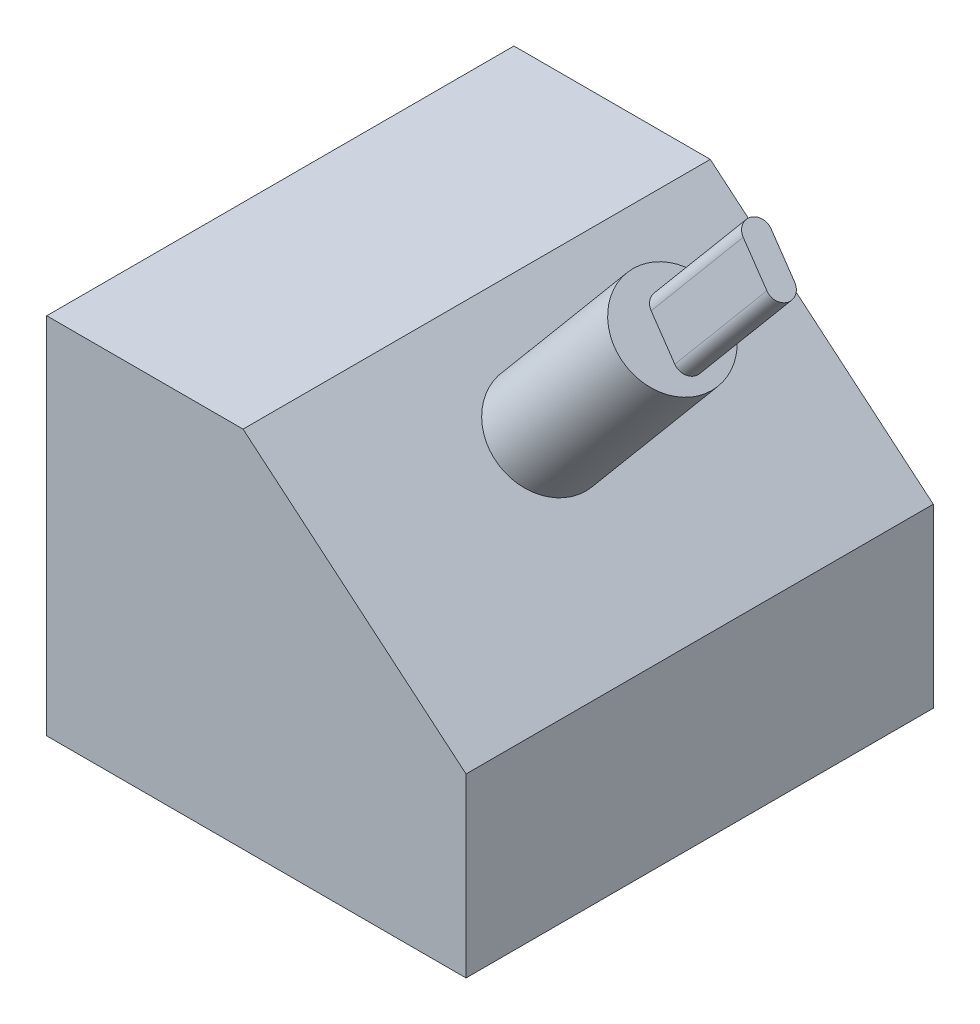
ISO-10303-21;
HEADER;
FILE_DESCRIPTION(('STEP AP214'),'2;1');
FILE_NAME('part.step','',(''),(''),'','','');
FILE_SCHEMA(('AUTOMOTIVE_DESIGN { 1 0 10303 214 1 1 1 1 }'));
ENDSEC;
DATA;
#1=APPLICATION_CONTEXT('core data for automotive mechanical design processes');
#2=APPLICATION_PROTOCOL_DEFINITION('international standard','automotive_design',2000,#1);
#3=PRODUCT_CONTEXT('',#1,'mechanical');
#4=PRODUCT('Part','Part','',(#3));
#5=PRODUCT_RELATED_PRODUCT_CATEGORY('part','',(#4));
#6=PRODUCT_DEFINITION_FORMATION('','',#4);
#7=PRODUCT_DEFINITION_CONTEXT('part definition',#1,'design');
#8=PRODUCT_DEFINITION('design','',#6,#7);
#9=PRODUCT_DEFINITION_SHAPE('','',#8);
#10=(LENGTH_UNIT() NAMED_UNIT(*) SI_UNIT(.MILLI.,.METRE.));
#11=(NAMED_UNIT(*) PLANE_ANGLE_UNIT() SI_UNIT($,.RADIAN.));
#12=(NAMED_UNIT(*) SI_UNIT($,.STERADIAN.) SOLID_ANGLE_UNIT());
#13=UNCERTAINTY_MEASURE_WITH_UNIT(LENGTH_MEASURE(1.E-05),#10,'distance_accuracy_value','');
#14=(GEOMETRIC_REPRESENTATION_CONTEXT(3) GLOBAL_UNCERTAINTY_ASSIGNED_CONTEXT((#13)) GLOBAL_UNIT_ASSIGNED_CONTEXT((#10,
#11,#12)) REPRESENTATION_CONTEXT('',''));
#15=CARTESIAN_POINT('',(0.,0.,0.));
#16=DIRECTION('',(0.,0.,1.));
#17=DIRECTION('',(1.,0.,0.));
#18=AXIS2_PLACEMENT_3D('',#15,#16,#17);
#19=CARTESIAN_POINT('',(53.774321567128,58.9594315493653,32.7409777812591));
#20=DIRECTION('',(0.642871248750167,0.765974253829984,0.));
#21=DIRECTION('',(-0.765974253829984,0.642871248750167,0.));
#22=AXIS2_PLACEMENT_3D('',#19,#20,#21);
#23=PLANE('',#22);
#24=CARTESIAN_POINT('',(53.774321567128,58.9594315493653,32.7409777812591));
#25=DIRECTION('',(0.642871248750167,0.765974253829984,0.));
#26=DIRECTION('',(-0.765974253829984,0.642871248750167,0.));
#27=AXIS2_PLACEMENT_3D('',#24,#25,#26);
#28=CIRCLE('',#27,6.82904646741875);
#29=CARTESIAN_POINT('',(48.5434477948766,63.3496291796477,32.7409777812591));
#30=VERTEX_POINT('',#29);
#31=EDGE_CURVE('E126',#30,#30,#28,.T.);
#32=ORIENTED_EDGE('',*,*,#31,.T.);
#33=EDGE_LOOP('',(#32));
#34=FACE_BOUND('',#33,.T.);
#35=DIRECTION('',(-0.752120673916443,0.631244137037017,-0.189328633132625));
#36=VECTOR('',#35,1.);
#37=CARTESIAN_POINT('',(56.5061619228199,56.6666369651238,31.462680008515));
#38=LINE('',#37,#36);
#39=CARTESIAN_POINT('',(56.5061619228199,56.6666369651238,31.462680008515));
#40=VERTEX_POINT('',#39);
#41=CARTESIAN_POINT('',(52.3137409438222,60.1852760010683,30.4073369485549));
#42=VERTEX_POINT('',#41);
#43=EDGE_CURVE('E163',#40,#42,#38,.T.);
#44=ORIENTED_EDGE('',*,*,#43,.F.);
#45=CARTESIAN_POINT('',(56.2682050488545,56.866350770059,33.0738491582281));
#46=DIRECTION('',(0.642871248750167,0.765974253829984,0.));
#47=DIRECTION('',(-0.765974253829984,0.642871248750167,0.));
#48=AXIS2_PLACEMENT_3D('',#45,#46,#47);
#49=CIRCLE('',#48,1.6408458509977);
#50=CARTESIAN_POINT('',(56.0302481748891,57.0660645749943,34.6850183079412));
#51=VERTEX_POINT('',#50);
#52=EDGE_CURVE('E166',#51,#40,#49,.T.);
#53=ORIENTED_EDGE('',*,*,#52,.F.);
#54=DIRECTION('',(0.752120673916443,-0.631244137037016,0.189328633132625));
#55=VECTOR('',#54,1.);
#56=CARTESIAN_POINT('',(56.0302481748891,57.0660645749943,34.6850183079412));
#57=LINE('',#56,#55);
#58=CARTESIAN_POINT('',(51.8378271958914,60.5847036109388,33.6296752479812));
#59=VERTEX_POINT('',#58);
#60=EDGE_CURVE('E158',#59,#51,#57,.T.);
#61=ORIENTED_EDGE('',*,*,#60,.F.);
#62=CARTESIAN_POINT('',(52.0757840698568,60.3849898060035,32.0185060982681));
#63=DIRECTION('',(0.642871248750167,0.765974253829984,0.));
#64=DIRECTION('',(-0.765974253829984,0.642871248750167,0.));
#65=AXIS2_PLACEMENT_3D('',#62,#63,#64);
#66=CIRCLE('',#65,1.6408458509977);
#67=EDGE_CURVE('E161',#42,#59,#66,.T.);
#68=ORIENTED_EDGE('',*,*,#67,.F.);
#69=EDGE_LOOP('',(#44,#53,#61,#68));
#70=FACE_BOUND('',#69,.T.);
#71=ADVANCED_FACE('F33',(#34,#70),#23,.T.);
#72=CARTESIAN_POINT('',(55.6440116915413,0.,62.));
#73=DIRECTION('',(0.,1.,0.));
#74=DIRECTION('',(0.,0.,1.));
#75=AXIS2_PLACEMENT_3D('',#72,#73,#74);
#76=PLANE('',#75);
#77=DIRECTION('',(1.,0.,0.));
#78=VECTOR('',#77,1.);
#79=CARTESIAN_POINT('',(55.6440116915413,0.,0.));
#80=LINE('',#79,#78);
#81=CARTESIAN_POINT('',(0.,0.,0.));
#82=VERTEX_POINT('',#81);
#83=CARTESIAN_POINT('',(55.6440116915413,0.,0.));
#84=VERTEX_POINT('',#83);
#85=EDGE_CURVE('E122',#82,#84,#80,.T.);
#86=ORIENTED_EDGE('',*,*,#85,.T.);
#87=DIRECTION('',(0.,0.,-1.));
#88=VECTOR('',#87,1.);
#89=CARTESIAN_POINT('',(55.6440116915413,0.,62.));
#90=LINE('',#89,#88);
#91=CARTESIAN_POINT('',(55.6440116915413,0.,62.));
#92=VERTEX_POINT('',#91);
#93=EDGE_CURVE('E41',#92,#84,#90,.T.);
#94=ORIENTED_EDGE('',*,*,#93,.F.);
#95=DIRECTION('',(1.,0.,0.));
#96=VECTOR('',#95,1.);
#97=CARTESIAN_POINT('',(55.6440116915413,0.,62.));
#98=LINE('',#97,#96);
#99=CARTESIAN_POINT('',(0.,0.,62.));
#100=VERTEX_POINT('',#99);
#101=EDGE_CURVE('E132',#100,#92,#98,.T.);
#102=ORIENTED_EDGE('',*,*,#101,.F.);
#103=DIRECTION('',(0.,0.,-1.));
#104=VECTOR('',#103,1.);
#105=CARTESIAN_POINT('',(0.,0.,62.));
#106=LINE('',#105,#104);
#107=EDGE_CURVE('E118',#100,#82,#106,.T.);
#108=ORIENTED_EDGE('',*,*,#107,.T.);
#109=EDGE_LOOP('',(#86,#94,#102,#108));
#110=FACE_BOUND('',#109,.T.);
#111=ADVANCED_FACE('F35',(#110),#76,.F.);
#112=CARTESIAN_POINT('',(55.6440116915413,23.4465277029976,62.));
#113=DIRECTION('',(-1.,0.,0.));
#114=DIRECTION('',(0.,0.,1.));
#115=AXIS2_PLACEMENT_3D('',#112,#113,#114);
#116=PLANE('',#115);
#117=DIRECTION('',(0.,1.,0.));
#118=VECTOR('',#117,1.);
#119=CARTESIAN_POINT('',(55.6440116915413,23.4465277029976,0.));
#120=LINE('',#119,#118);
#121=CARTESIAN_POINT('',(55.6440116915413,23.4465277029976,0.));
#122=VERTEX_POINT('',#121);
#123=EDGE_CURVE('E125',#84,#122,#120,.T.);
#124=ORIENTED_EDGE('',*,*,#123,.T.);
#125=DIRECTION('',(0.,0.,-1.));
#126=VECTOR('',#125,1.);
#127=CARTESIAN_POINT('',(55.6440116915413,23.4465277029976,62.));
#128=LINE('',#127,#126);
#129=CARTESIAN_POINT('',(55.6440116915413,23.4465277029976,62.));
#130=VERTEX_POINT('',#129);
#131=EDGE_CURVE('E113',#130,#122,#128,.T.);
#132=ORIENTED_EDGE('',*,*,#131,.F.);
#133=DIRECTION('',(0.,1.,0.));
#134=VECTOR('',#133,1.);
#135=CARTESIAN_POINT('',(55.6440116915413,23.4465277029976,62.));
#136=LINE('',#135,#134);
#137=EDGE_CURVE('E90',#92,#130,#136,.T.);
#138=ORIENTED_EDGE('',*,*,#137,.F.);
#139=ORIENTED_EDGE('',*,*,#93,.T.);
#140=EDGE_LOOP('',(#124,#132,#138,#139));
#141=FACE_BOUND('',#140,.T.);
#142=ADVANCED_FACE('F136',(#141),#116,.F.);
#143=CARTESIAN_POINT('',(26.053837569146,48.2811381271508,62.));
#144=DIRECTION('',(-0.642871248750167,-0.765974253829985,0.));
#145=DIRECTION('',(0.765974253829985,-0.642871248750167,0.));
#146=AXIS2_PLACEMENT_3D('',#143,#144,#145);
#147=PLANE('',#146);
#148=CARTESIAN_POINT('',(37.0596690996236,39.0441009497856,32.7409777812591));
#149=DIRECTION('',(-0.642871248750167,-0.765974253829985,0.));
#150=DIRECTION('',(0.765974253829985,-0.642871248750167,0.));
#151=AXIS2_PLACEMENT_3D('',#148,#149,#150);
#152=CIRCLE('',#151,6.82904646741875);
#153=CARTESIAN_POINT('',(42.290542871875,34.6539033195032,32.7409777812591));
#154=VERTEX_POINT('',#153);
#155=EDGE_CURVE('E11',#154,#154,#152,.F.);
#156=ORIENTED_EDGE('',*,*,#155,.F.);
#157=EDGE_LOOP('',(#156));
#158=FACE_BOUND('',#157,.T.);
#159=DIRECTION('',(-0.765974253829985,0.642871248750167,0.));
#160=VECTOR('',#159,1.);
#161=CARTESIAN_POINT('',(26.053837569146,48.2811381271508,0.));
#162=LINE('',#161,#160);
#163=CARTESIAN_POINT('',(26.053837569146,48.2811381271508,0.));
#164=VERTEX_POINT('',#163);
#165=EDGE_CURVE('E110',#122,#164,#162,.T.);
#166=ORIENTED_EDGE('',*,*,#165,.T.);
#167=DIRECTION('',(0.,0.,-1.));
#168=VECTOR('',#167,1.);
#169=CARTESIAN_POINT('',(26.053837569146,48.2811381271508,62.));
#170=LINE('',#169,#168);
#171=CARTESIAN_POINT('',(26.053837569146,48.2811381271508,62.));
#172=VERTEX_POINT('',#171);
#173=EDGE_CURVE('E107',#172,#164,#170,.T.);
#174=ORIENTED_EDGE('',*,*,#173,.F.);
#175=DIRECTION('',(-0.765974253829985,0.642871248750167,0.));
#176=VECTOR('',#175,1.);
#177=CARTESIAN_POINT('',(26.053837569146,48.2811381271508,62.));
#178=LINE('',#177,#176);
#179=EDGE_CURVE('E97',#130,#172,#178,.T.);
#180=ORIENTED_EDGE('',*,*,#179,.F.);
#181=ORIENTED_EDGE('',*,*,#131,.T.);
#182=EDGE_LOOP('',(#166,#174,#180,#181));
#183=FACE_BOUND('',#182,.T.);
#184=ADVANCED_FACE('F108',(#158,#183),#147,.F.);
#185=CARTESIAN_POINT('',(0.,48.2811381271508,62.));
#186=DIRECTION('',(0.,-1.,0.));
#187=DIRECTION('',(0.,0.,-1.));
#188=AXIS2_PLACEMENT_3D('',#185,#186,#187);
#189=PLANE('',#188);
#190=DIRECTION('',(-1.,0.,0.));
#191=VECTOR('',#190,1.);
#192=CARTESIAN_POINT('',(0.,48.2811381271508,0.));
#193=LINE('',#192,#191);
#194=CARTESIAN_POINT('',(0.,48.2811381271508,0.));
#195=VERTEX_POINT('',#194);
#196=EDGE_CURVE('E129',#164,#195,#193,.T.);
#197=ORIENTED_EDGE('',*,*,#196,.T.);
#198=DIRECTION('',(0.,0.,-1.));
#199=VECTOR('',#198,1.);
#200=CARTESIAN_POINT('',(0.,48.2811381271508,62.));
#201=LINE('',#200,#199);
#202=CARTESIAN_POINT('',(0.,48.2811381271508,62.));
#203=VERTEX_POINT('',#202);
#204=EDGE_CURVE('E114',#203,#195,#201,.T.);
#205=ORIENTED_EDGE('',*,*,#204,.F.);
#206=DIRECTION('',(-1.,0.,0.));
#207=VECTOR('',#206,1.);
#208=CARTESIAN_POINT('',(0.,48.2811381271508,62.));
#209=LINE('',#208,#207);
#210=EDGE_CURVE('E101',#172,#203,#209,.T.);
#211=ORIENTED_EDGE('',*,*,#210,.F.);
#212=ORIENTED_EDGE('',*,*,#173,.T.);
#213=EDGE_LOOP('',(#197,#205,#211,#212));
#214=FACE_BOUND('',#213,.T.);
#215=ADVANCED_FACE('F116',(#214),#189,.F.);
#216=CARTESIAN_POINT('',(0.,0.,62.));
#217=DIRECTION('',(1.,0.,0.));
#218=DIRECTION('',(0.,0.,-1.));
#219=AXIS2_PLACEMENT_3D('',#216,#217,#218);
#220=PLANE('',#219);
#221=DIRECTION('',(0.,-1.,0.));
#222=VECTOR('',#221,1.);
#223=CARTESIAN_POINT('',(0.,0.,0.));
#224=LINE('',#223,#222);
#225=EDGE_CURVE('E81',#195,#82,#224,.T.);
#226=ORIENTED_EDGE('',*,*,#225,.T.);
#227=ORIENTED_EDGE('',*,*,#107,.F.);
#228=DIRECTION('',(0.,-1.,0.));
#229=VECTOR('',#228,1.);
#230=CARTESIAN_POINT('',(0.,0.,62.));
#231=LINE('',#230,#229);
#232=EDGE_CURVE('E57',#203,#100,#231,.T.);
#233=ORIENTED_EDGE('',*,*,#232,.F.);
#234=ORIENTED_EDGE('',*,*,#204,.T.);
#235=EDGE_LOOP('',(#226,#227,#233,#234));
#236=FACE_BOUND('',#235,.T.);
#237=ADVANCED_FACE('F142',(#236),#220,.F.);
#238=CARTESIAN_POINT('',(0.,0.,62.));
#239=DIRECTION('',(0.,0.,-1.));
#240=DIRECTION('',(-1.,0.,0.));
#241=AXIS2_PLACEMENT_3D('',#238,#239,#240);
#242=PLANE('',#241);
#243=ORIENTED_EDGE('',*,*,#101,.T.);
#244=ORIENTED_EDGE('',*,*,#137,.T.);
#245=ORIENTED_EDGE('',*,*,#179,.T.);
#246=ORIENTED_EDGE('',*,*,#210,.T.);
#247=ORIENTED_EDGE('',*,*,#232,.T.);
#248=EDGE_LOOP('',(#243,#244,#245,#246,#247));
#249=FACE_BOUND('',#248,.T.);
#250=ADVANCED_FACE('F99',(#249),#242,.F.);
#251=CARTESIAN_POINT('',(0.,0.,0.));
#252=DIRECTION('',(0.,0.,-1.));
#253=DIRECTION('',(-1.,0.,0.));
#254=AXIS2_PLACEMENT_3D('',#251,#252,#253);
#255=PLANE('',#254);
#256=ORIENTED_EDGE('',*,*,#85,.F.);
#257=ORIENTED_EDGE('',*,*,#225,.F.);
#258=ORIENTED_EDGE('',*,*,#196,.F.);
#259=ORIENTED_EDGE('',*,*,#165,.F.);
#260=ORIENTED_EDGE('',*,*,#123,.F.);
#261=EDGE_LOOP('',(#256,#257,#258,#259,#260));
#262=FACE_BOUND('',#261,.T.);
#263=ADVANCED_FACE('F141',(#262),#255,.T.);
#264=CARTESIAN_POINT('',(53.774321567128,58.9594315493653,32.7409777812591));
#265=DIRECTION('',(-0.642871248750167,-0.765974253829984,0.));
#266=DIRECTION('',(0.765974253829984,-0.642871248750167,0.));
#267=AXIS2_PLACEMENT_3D('',#264,#265,#266);
#268=CYLINDRICAL_SURFACE('',#267,6.82904646741875);
#269=ORIENTED_EDGE('',*,*,#31,.F.);
#270=EDGE_LOOP('',(#269));
#271=FACE_BOUND('',#270,.T.);
#272=ORIENTED_EDGE('',*,*,#155,.T.);
#273=EDGE_LOOP('',(#272));
#274=FACE_BOUND('',#273,.T.);
#275=ADVANCED_FACE('F217',(#271,#274),#268,.T.);
#276=CARTESIAN_POINT('',(68.4827587751077,71.4198615928288,33.0738491582281));
#277=DIRECTION('',(-0.642871248750167,-0.765974253829984,0.));
#278=DIRECTION('',(0.765974253829984,-0.642871248750167,0.));
#279=AXIS2_PLACEMENT_3D('',#276,#277,#278);
#280=CYLINDRICAL_SURFACE('',#279,1.6408458509977);
#281=ORIENTED_EDGE('',*,*,#52,.T.);
#282=DIRECTION('',(-0.642871248750167,-0.765974253829984,0.));
#283=VECTOR('',#282,1.);
#284=CARTESIAN_POINT('',(68.7207156490731,71.2201477878935,31.462680008515));
#285=LINE('',#284,#283);
#286=CARTESIAN_POINT('',(68.7207156490731,71.2201477878935,31.462680008515));
#287=VERTEX_POINT('',#286);
#288=EDGE_CURVE('E147',#287,#40,#285,.T.);
#289=ORIENTED_EDGE('',*,*,#288,.F.);
#290=CARTESIAN_POINT('',(68.4827587751077,71.4198615928288,33.0738491582281));
#291=DIRECTION('',(0.642871248750167,0.765974253829984,0.));
#292=DIRECTION('',(-0.765974253829984,0.642871248750167,0.));
#293=AXIS2_PLACEMENT_3D('',#290,#291,#292);
#294=CIRCLE('',#293,1.6408458509977);
#295=CARTESIAN_POINT('',(68.2448019011423,71.619575397764,34.6850183079412));
#296=VERTEX_POINT('',#295);
#297=EDGE_CURVE('E160',#296,#287,#294,.T.);
#298=ORIENTED_EDGE('',*,*,#297,.F.);
#299=DIRECTION('',(-0.642871248750167,-0.765974253829984,0.));
#300=VECTOR('',#299,1.);
#301=CARTESIAN_POINT('',(68.2448019011423,71.619575397764,34.6850183079412));
#302=LINE('',#301,#300);
#303=EDGE_CURVE('E154',#296,#51,#302,.T.);
#304=ORIENTED_EDGE('',*,*,#303,.T.);
#305=EDGE_LOOP('',(#281,#289,#298,#304));
#306=FACE_BOUND('',#305,.T.);
#307=ADVANCED_FACE('F189',(#306),#280,.T.);
#308=CARTESIAN_POINT('',(68.7207156490731,71.2201477878935,31.462680008515));
#309=DIRECTION('',(-0.145020858492413,0.121713934806133,0.981913778636461));
#310=DIRECTION('',(0.989268773269933,0.,0.146107132724591));
#311=AXIS2_PLACEMENT_3D('',#308,#309,#310);
#312=PLANE('',#311);
#313=ORIENTED_EDGE('',*,*,#43,.T.);
#314=DIRECTION('',(-0.642871248750167,-0.765974253829984,0.));
#315=VECTOR('',#314,1.);
#316=CARTESIAN_POINT('',(64.5282946700754,74.738786823838,30.4073369485549));
#317=LINE('',#316,#315);
#318=CARTESIAN_POINT('',(64.5282946700754,74.738786823838,30.4073369485549));
#319=VERTEX_POINT('',#318);
#320=EDGE_CURVE('E150',#319,#42,#317,.T.);
#321=ORIENTED_EDGE('',*,*,#320,.F.);
#322=DIRECTION('',(-0.752120673916443,0.631244137037017,-0.189328633132625));
#323=VECTOR('',#322,1.);
#324=CARTESIAN_POINT('',(68.7207156490731,71.2201477878935,31.462680008515));
#325=LINE('',#324,#323);
#326=EDGE_CURVE('E174',#287,#319,#325,.T.);
#327=ORIENTED_EDGE('',*,*,#326,.F.);
#328=ORIENTED_EDGE('',*,*,#288,.T.);
#329=EDGE_LOOP('',(#313,#321,#327,#328));
#330=FACE_BOUND('',#329,.T.);
#331=ADVANCED_FACE('F194',(#330),#312,.F.);
#332=CARTESIAN_POINT('',(64.29033779611,74.9385006287733,32.0185060982681));
#333=DIRECTION('',(-0.642871248750167,-0.765974253829984,0.));
#334=DIRECTION('',(0.765974253829984,-0.642871248750167,0.));
#335=AXIS2_PLACEMENT_3D('',#332,#333,#334);
#336=CYLINDRICAL_SURFACE('',#335,1.6408458509977);
#337=ORIENTED_EDGE('',*,*,#67,.T.);
#338=DIRECTION('',(-0.642871248750167,-0.765974253829984,0.));
#339=VECTOR('',#338,1.);
#340=CARTESIAN_POINT('',(64.0523809221446,75.1382144337085,33.6296752479812));
#341=LINE('',#340,#339);
#342=CARTESIAN_POINT('',(64.0523809221446,75.1382144337085,33.6296752479812));
#343=VERTEX_POINT('',#342);
#344=EDGE_CURVE('E48',#343,#59,#341,.T.);
#345=ORIENTED_EDGE('',*,*,#344,.F.);
#346=CARTESIAN_POINT('',(64.29033779611,74.9385006287733,32.0185060982681));
#347=DIRECTION('',(0.642871248750167,0.765974253829984,0.));
#348=DIRECTION('',(-0.765974253829984,0.642871248750167,0.));
#349=AXIS2_PLACEMENT_3D('',#346,#347,#348);
#350=CIRCLE('',#349,1.6408458509977);
#351=EDGE_CURVE('E171',#319,#343,#350,.T.);
#352=ORIENTED_EDGE('',*,*,#351,.F.);
#353=ORIENTED_EDGE('',*,*,#320,.T.);
#354=EDGE_LOOP('',(#337,#345,#352,#353));
#355=FACE_BOUND('',#354,.T.);
#356=ADVANCED_FACE('F203',(#355),#336,.T.);
#357=CARTESIAN_POINT('',(68.2448019011423,71.619575397764,34.6850183079412));
#358=DIRECTION('',(0.145020858492413,-0.121713934806133,-0.981913778636461));
#359=DIRECTION('',(-0.989268773269933,0.,-0.146107132724591));
#360=AXIS2_PLACEMENT_3D('',#357,#358,#359);
#361=PLANE('',#360);
#362=ORIENTED_EDGE('',*,*,#60,.T.);
#363=ORIENTED_EDGE('',*,*,#303,.F.);
#364=DIRECTION('',(0.752120673916443,-0.631244137037016,0.189328633132625));
#365=VECTOR('',#364,1.);
#366=CARTESIAN_POINT('',(68.2448019011423,71.619575397764,34.6850183079412));
#367=LINE('',#366,#365);
#368=EDGE_CURVE('E157',#343,#296,#367,.T.);
#369=ORIENTED_EDGE('',*,*,#368,.F.);
#370=ORIENTED_EDGE('',*,*,#344,.T.);
#371=EDGE_LOOP('',(#362,#363,#369,#370));
#372=FACE_BOUND('',#371,.T.);
#373=ADVANCED_FACE('F206',(#372),#361,.F.);
#374=CARTESIAN_POINT('',(68.4827587751077,71.4198615928288,33.0738491582281));
#375=DIRECTION('',(0.642871248750167,0.765974253829984,0.));
#376=DIRECTION('',(-0.765974253829984,0.642871248750167,0.));
#377=AXIS2_PLACEMENT_3D('',#374,#375,#376);
#378=PLANE('',#377);
#379=ORIENTED_EDGE('',*,*,#297,.T.);
#380=ORIENTED_EDGE('',*,*,#326,.T.);
#381=ORIENTED_EDGE('',*,*,#351,.T.);
#382=ORIENTED_EDGE('',*,*,#368,.T.);
#383=EDGE_LOOP('',(#379,#380,#381,#382));
#384=FACE_BOUND('',#383,.T.);
#385=ADVANCED_FACE('F182',(#384),#378,.T.);
#386=CLOSED_SHELL('',(#71,#111,#142,#184,#215,#237,#250,#263,#275,#307,#331,#356,#373,#385));
#387=MANIFOLD_SOLID_BREP('B2',#386);
#388=ADVANCED_BREP_SHAPE_REPRESENTATION('',(#18,#387),#14);
#389=SHAPE_DEFINITION_REPRESENTATION(#9,#388);
ENDSEC;
END-ISO-10303-21;
